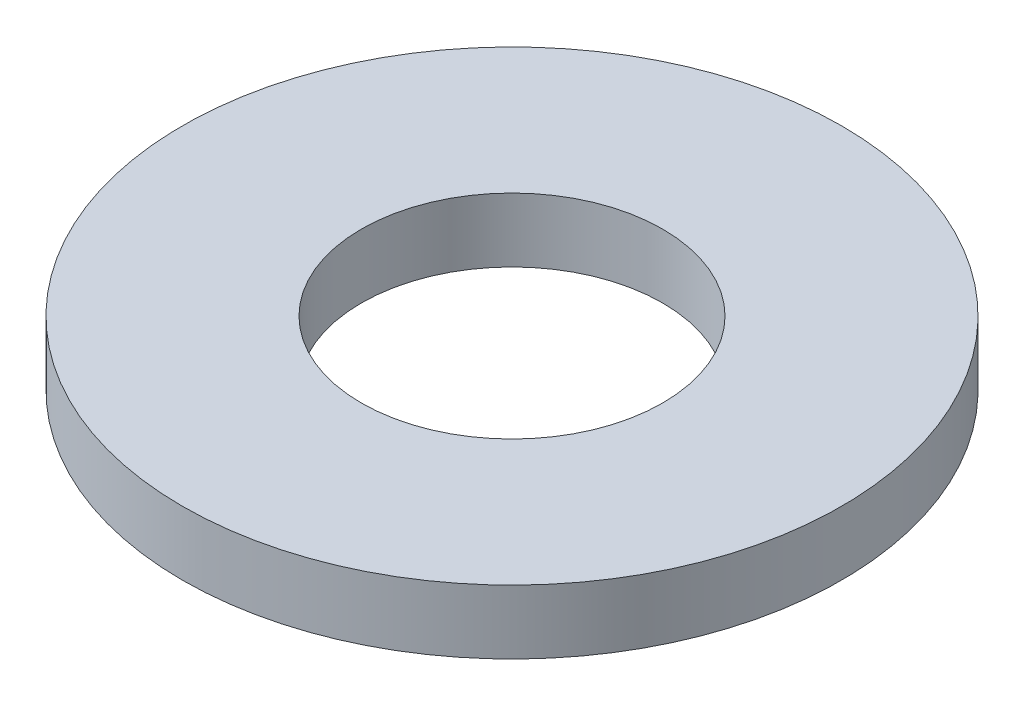
ISO-10303-21;
HEADER;
FILE_DESCRIPTION(('STEP AP214'),'2;1');
FILE_NAME('part.step','',(''),(''),'','','');
FILE_SCHEMA(('AUTOMOTIVE_DESIGN { 1 0 10303 214 1 1 1 1 }'));
ENDSEC;
DATA;
#1=APPLICATION_CONTEXT('core data for automotive mechanical design processes');
#2=APPLICATION_PROTOCOL_DEFINITION('international standard','automotive_design',2000,#1);
#3=PRODUCT_CONTEXT('',#1,'mechanical');
#4=PRODUCT('Part','Part','',(#3));
#5=PRODUCT_RELATED_PRODUCT_CATEGORY('part','',(#4));
#6=PRODUCT_DEFINITION_FORMATION('','',#4);
#7=PRODUCT_DEFINITION_CONTEXT('part definition',#1,'design');
#8=PRODUCT_DEFINITION('design','',#6,#7);
#9=PRODUCT_DEFINITION_SHAPE('','',#8);
#10=(LENGTH_UNIT() NAMED_UNIT(*) SI_UNIT(.MILLI.,.METRE.));
#11=(NAMED_UNIT(*) PLANE_ANGLE_UNIT() SI_UNIT($,.RADIAN.));
#12=(NAMED_UNIT(*) SI_UNIT($,.STERADIAN.) SOLID_ANGLE_UNIT());
#13=UNCERTAINTY_MEASURE_WITH_UNIT(LENGTH_MEASURE(1.E-05),#10,'distance_accuracy_value','');
#14=(GEOMETRIC_REPRESENTATION_CONTEXT(3) GLOBAL_UNCERTAINTY_ASSIGNED_CONTEXT((#13)) GLOBAL_UNIT_ASSIGNED_CONTEXT((#10,
#11,#12)) REPRESENTATION_CONTEXT('',''));
#15=CARTESIAN_POINT('',(0.,0.,0.));
#16=DIRECTION('',(0.,0.,1.));
#17=DIRECTION('',(1.,0.,0.));
#18=AXIS2_PLACEMENT_3D('',#15,#16,#17);
#19=CARTESIAN_POINT('',(0.,17.,0.));
#20=DIRECTION('',(0.,-1.,0.));
#21=DIRECTION('',(0.,0.,-1.));
#22=AXIS2_PLACEMENT_3D('',#19,#20,#21);
#23=CYLINDRICAL_SURFACE('',#22,87.5);
#24=CARTESIAN_POINT('',(0.,17.,0.));
#25=DIRECTION('',(0.,1.,0.));
#26=DIRECTION('',(0.,0.,1.));
#27=AXIS2_PLACEMENT_3D('',#24,#25,#26);
#28=CIRCLE('',#27,87.5);
#29=CARTESIAN_POINT('',(0.,17.,87.5));
#30=VERTEX_POINT('',#29);
#31=EDGE_CURVE('E10',#30,#30,#28,.T.);
#32=ORIENTED_EDGE('',*,*,#31,.F.);
#33=EDGE_LOOP('',(#32));
#34=FACE_BOUND('',#33,.T.);
#35=CARTESIAN_POINT('',(0.,0.,0.));
#36=DIRECTION('',(0.,1.,0.));
#37=DIRECTION('',(0.,0.,1.));
#38=AXIS2_PLACEMENT_3D('',#35,#36,#37);
#39=CIRCLE('',#38,87.5);
#40=CARTESIAN_POINT('',(0.,0.,87.5));
#41=VERTEX_POINT('',#40);
#42=EDGE_CURVE('E37',#41,#41,#39,.T.);
#43=ORIENTED_EDGE('',*,*,#42,.T.);
#44=EDGE_LOOP('',(#43));
#45=FACE_BOUND('',#44,.T.);
#46=ADVANCED_FACE('F40',(#34,#45),#23,.T.);
#47=CARTESIAN_POINT('',(0.,17.,0.));
#48=DIRECTION('',(0.,1.,0.));
#49=DIRECTION('',(0.,0.,1.));
#50=AXIS2_PLACEMENT_3D('',#47,#48,#49);
#51=PLANE('',#50);
#52=CARTESIAN_POINT('',(0.,17.,0.));
#53=DIRECTION('',(0.,1.,0.));
#54=DIRECTION('',(0.,0.,1.));
#55=AXIS2_PLACEMENT_3D('',#52,#53,#54);
#56=CIRCLE('',#55,40.);
#57=CARTESIAN_POINT('',(0.,17.,40.));
#58=VERTEX_POINT('',#57);
#59=EDGE_CURVE('E50',#58,#58,#56,.T.);
#60=ORIENTED_EDGE('',*,*,#59,.F.);
#61=EDGE_LOOP('',(#60));
#62=FACE_BOUND('',#61,.T.);
#63=ORIENTED_EDGE('',*,*,#31,.T.);
#64=EDGE_LOOP('',(#63));
#65=FACE_BOUND('',#64,.T.);
#66=ADVANCED_FACE('F59',(#62,#65),#51,.T.);
#67=CARTESIAN_POINT('',(0.,0.,0.));
#68=DIRECTION('',(0.,1.,0.));
#69=DIRECTION('',(0.,0.,1.));
#70=AXIS2_PLACEMENT_3D('',#67,#68,#69);
#71=PLANE('',#70);
#72=CARTESIAN_POINT('',(0.,0.,0.));
#73=DIRECTION('',(0.,1.,0.));
#74=DIRECTION('',(0.,0.,1.));
#75=AXIS2_PLACEMENT_3D('',#72,#73,#74);
#76=CIRCLE('',#75,40.);
#77=CARTESIAN_POINT('',(0.,0.,40.));
#78=VERTEX_POINT('',#77);
#79=EDGE_CURVE('E47',#78,#78,#76,.T.);
#80=ORIENTED_EDGE('',*,*,#79,.T.);
#81=EDGE_LOOP('',(#80));
#82=FACE_BOUND('',#81,.T.);
#83=ORIENTED_EDGE('',*,*,#42,.F.);
#84=EDGE_LOOP('',(#83));
#85=FACE_BOUND('',#84,.T.);
#86=ADVANCED_FACE('F58',(#82,#85),#71,.F.);
#87=CARTESIAN_POINT('',(0.,17.,0.));
#88=DIRECTION('',(0.,-1.,0.));
#89=DIRECTION('',(0.,0.,-1.));
#90=AXIS2_PLACEMENT_3D('',#87,#88,#89);
#91=CYLINDRICAL_SURFACE('',#90,40.);
#92=ORIENTED_EDGE('',*,*,#59,.T.);
#93=EDGE_LOOP('',(#92));
#94=FACE_BOUND('',#93,.T.);
#95=ORIENTED_EDGE('',*,*,#79,.F.);
#96=EDGE_LOOP('',(#95));
#97=FACE_BOUND('',#96,.T.);
#98=ADVANCED_FACE('F54',(#94,#97),#91,.F.);
#99=CLOSED_SHELL('',(#46,#66,#86,#98));
#100=MANIFOLD_SOLID_BREP('B2',#99);
#101=ADVANCED_BREP_SHAPE_REPRESENTATION('',(#18,#100),#14);
#102=SHAPE_DEFINITION_REPRESENTATION(#9,#101);
ENDSEC;
END-ISO-10303-21;
